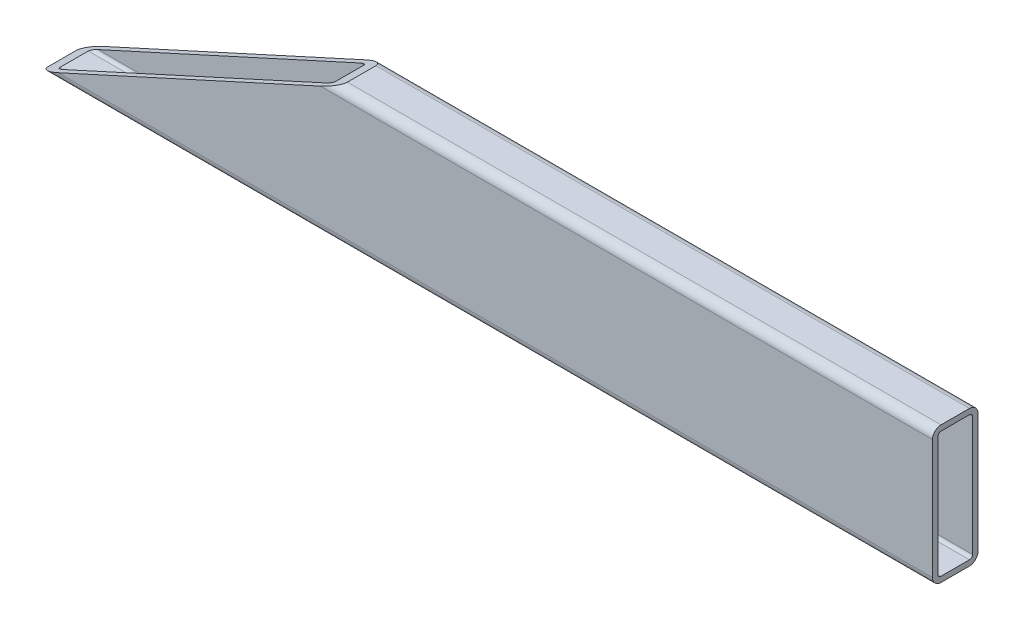
ISO-10303-21;
HEADER;
FILE_DESCRIPTION(('STEP AP214'),'2;1');
FILE_NAME('part.step','',(''),(''),'','','');
FILE_SCHEMA(('AUTOMOTIVE_DESIGN { 1 0 10303 214 1 1 1 1 }'));
ENDSEC;
DATA;
#1=APPLICATION_CONTEXT('core data for automotive mechanical design processes');
#2=APPLICATION_PROTOCOL_DEFINITION('international standard','automotive_design',2000,#1);
#3=PRODUCT_CONTEXT('',#1,'mechanical');
#4=PRODUCT('Part','Part','',(#3));
#5=PRODUCT_RELATED_PRODUCT_CATEGORY('part','',(#4));
#6=PRODUCT_DEFINITION_FORMATION('','',#4);
#7=PRODUCT_DEFINITION_CONTEXT('part definition',#1,'design');
#8=PRODUCT_DEFINITION('design','',#6,#7);
#9=PRODUCT_DEFINITION_SHAPE('','',#8);
#10=(LENGTH_UNIT() NAMED_UNIT(*) SI_UNIT(.MILLI.,.METRE.));
#11=(NAMED_UNIT(*) PLANE_ANGLE_UNIT() SI_UNIT($,.RADIAN.));
#12=(NAMED_UNIT(*) SI_UNIT($,.STERADIAN.) SOLID_ANGLE_UNIT());
#13=UNCERTAINTY_MEASURE_WITH_UNIT(LENGTH_MEASURE(1.E-05),#10,'distance_accuracy_value','');
#14=(GEOMETRIC_REPRESENTATION_CONTEXT(3) GLOBAL_UNCERTAINTY_ASSIGNED_CONTEXT((#13)) GLOBAL_UNIT_ASSIGNED_CONTEXT((#10,
#11,#12)) REPRESENTATION_CONTEXT('',''));
#15=CARTESIAN_POINT('',(0.,0.,0.));
#16=DIRECTION('',(0.,0.,1.));
#17=DIRECTION('',(1.,0.,0.));
#18=AXIS2_PLACEMENT_3D('',#15,#16,#17);
#19=CARTESIAN_POINT('',(-249.2375,33.3375,7.93750000000006));
#20=DIRECTION('',(1.,0.,0.));
#21=DIRECTION('',(0.,0.,-1.));
#22=AXIS2_PLACEMENT_3D('',#19,#20,#21);
#23=CYLINDRICAL_SURFACE('',#22,4.7625);
#24=CARTESIAN_POINT('',(-92.4822129548996,33.3375,7.93750000000002));
#25=DIRECTION('',(-0.414693242656243,0.909961270876541,0.));
#26=DIRECTION('',(0.909961270876541,0.414693242656243,0.));
#27=AXIS2_PLACEMENT_3D('',#24,#25,#26);
#28=ELLIPSE('',#27,11.4843925825621,4.7625);
#29=CARTESIAN_POINT('',(-92.4822129548995,33.3375,12.7));
#30=VERTEX_POINT('',#29);
#31=CARTESIAN_POINT('',(-82.0318604852262,38.1,7.93750000000006));
#32=VERTEX_POINT('',#31);
#33=EDGE_CURVE('E219',#30,#32,#28,.T.);
#34=ORIENTED_EDGE('',*,*,#33,.F.);
#35=DIRECTION('',(1.,0.,0.));
#36=VECTOR('',#35,1.);
#37=CARTESIAN_POINT('',(-249.2375,33.3375,12.7000000000001));
#38=LINE('',#37,#36);
#39=CARTESIAN_POINT('',(249.2375,33.3375,12.6999999999999));
#40=VERTEX_POINT('',#39);
#41=EDGE_CURVE('E154',#30,#40,#38,.T.);
#42=ORIENTED_EDGE('',*,*,#41,.T.);
#43=CARTESIAN_POINT('',(249.2375,33.3375,7.93749999999991));
#44=DIRECTION('',(-1.,0.,0.));
#45=DIRECTION('',(0.,0.,1.));
#46=AXIS2_PLACEMENT_3D('',#43,#44,#45);
#47=CIRCLE('',#46,4.7625);
#48=CARTESIAN_POINT('',(249.2375,38.1,7.93749999999991));
#49=VERTEX_POINT('',#48);
#50=EDGE_CURVE('E168',#40,#49,#47,.T.);
#51=ORIENTED_EDGE('',*,*,#50,.T.);
#52=DIRECTION('',(1.,0.,0.));
#53=VECTOR('',#52,1.);
#54=CARTESIAN_POINT('',(-249.2375,38.1,7.93750000000006));
#55=LINE('',#54,#53);
#56=EDGE_CURVE('E12',#32,#49,#55,.T.);
#57=ORIENTED_EDGE('',*,*,#56,.F.);
#58=EDGE_LOOP('',(#34,#42,#51,#57));
#59=FACE_BOUND('',#58,.T.);
#60=ADVANCED_FACE('F61',(#59),#23,.T.);
#61=CARTESIAN_POINT('',(-249.2375,38.1,7.93750000000006));
#62=DIRECTION('',(0.,-1.,0.));
#63=DIRECTION('',(0.,0.,-1.));
#64=AXIS2_PLACEMENT_3D('',#61,#62,#63);
#65=PLANE('',#64);
#66=DIRECTION('',(0.,0.,1.));
#67=VECTOR('',#66,1.);
#68=CARTESIAN_POINT('',(-82.0318604852262,38.1,-12.7000000000001));
#69=LINE('',#68,#67);
#70=CARTESIAN_POINT('',(-82.0318604852262,38.1,-7.93749999999996));
#71=VERTEX_POINT('',#70);
#72=EDGE_CURVE('E318',#71,#32,#69,.T.);
#73=ORIENTED_EDGE('',*,*,#72,.T.);
#74=ORIENTED_EDGE('',*,*,#56,.T.);
#75=DIRECTION('',(0.,0.,-1.));
#76=VECTOR('',#75,1.);
#77=CARTESIAN_POINT('',(249.2375,38.1,7.93749999999991));
#78=LINE('',#77,#76);
#79=CARTESIAN_POINT('',(249.2375,38.1,-7.93750000000009));
#80=VERTEX_POINT('',#79);
#81=EDGE_CURVE('E240',#49,#80,#78,.T.);
#82=ORIENTED_EDGE('',*,*,#81,.T.);
#83=DIRECTION('',(1.,0.,0.));
#84=VECTOR('',#83,1.);
#85=CARTESIAN_POINT('',(-249.2375,38.1,-7.93749999999994));
#86=LINE('',#85,#84);
#87=EDGE_CURVE('E70',#71,#80,#86,.T.);
#88=ORIENTED_EDGE('',*,*,#87,.F.);
#89=EDGE_LOOP('',(#73,#74,#82,#88));
#90=FACE_BOUND('',#89,.T.);
#91=ADVANCED_FACE('F319',(#90),#65,.F.);
#92=CARTESIAN_POINT('',(-249.2375,33.3375,-7.93749999999994));
#93=DIRECTION('',(1.,0.,0.));
#94=DIRECTION('',(0.,0.,-1.));
#95=AXIS2_PLACEMENT_3D('',#92,#93,#94);
#96=CYLINDRICAL_SURFACE('',#95,4.7625);
#97=CARTESIAN_POINT('',(-92.4822129548996,33.3375,-7.93749999999998));
#98=DIRECTION('',(-0.414693242656243,0.909961270876541,0.));
#99=DIRECTION('',(0.909961270876541,0.414693242656243,0.));
#100=AXIS2_PLACEMENT_3D('',#97,#98,#99);
#101=ELLIPSE('',#100,11.4843925825621,4.7625);
#102=CARTESIAN_POINT('',(-92.4822129548996,33.3375,-12.7000000000001));
#103=VERTEX_POINT('',#102);
#104=EDGE_CURVE('E315',#71,#103,#101,.T.);
#105=ORIENTED_EDGE('',*,*,#104,.F.);
#106=ORIENTED_EDGE('',*,*,#87,.T.);
#107=CARTESIAN_POINT('',(249.2375,33.3375,-7.93750000000009));
#108=DIRECTION('',(-1.,0.,0.));
#109=DIRECTION('',(0.,0.,1.));
#110=AXIS2_PLACEMENT_3D('',#107,#108,#109);
#111=CIRCLE('',#110,4.7625);
#112=CARTESIAN_POINT('',(249.2375,33.3375,-12.7000000000001));
#113=VERTEX_POINT('',#112);
#114=EDGE_CURVE('E243',#80,#113,#111,.T.);
#115=ORIENTED_EDGE('',*,*,#114,.T.);
#116=DIRECTION('',(1.,0.,0.));
#117=VECTOR('',#116,1.);
#118=CARTESIAN_POINT('',(-249.2375,33.3375,-12.6999999999999));
#119=LINE('',#118,#117);
#120=EDGE_CURVE('E182',#103,#113,#119,.T.);
#121=ORIENTED_EDGE('',*,*,#120,.F.);
#122=EDGE_LOOP('',(#105,#106,#115,#121));
#123=FACE_BOUND('',#122,.T.);
#124=ADVANCED_FACE('F269',(#123),#96,.T.);
#125=CARTESIAN_POINT('',(-249.2375,-33.3375,-12.6999999999999));
#126=DIRECTION('',(0.,0.,1.));
#127=DIRECTION('',(1.,0.,0.));
#128=AXIS2_PLACEMENT_3D('',#125,#126,#127);
#129=PLANE('',#128);
#130=DIRECTION('',(-0.909961270876541,-0.414693242656243,0.));
#131=VECTOR('',#130,1.);
#132=CARTESIAN_POINT('',(-28.4842763777462,62.5030399981183,-12.7000000000001));
#133=LINE('',#132,#131);
#134=CARTESIAN_POINT('',(-238.787147530327,-33.3375,-12.7000000000001));
#135=VERTEX_POINT('',#134);
#136=EDGE_CURVE('E266',#103,#135,#133,.T.);
#137=ORIENTED_EDGE('',*,*,#136,.F.);
#138=ORIENTED_EDGE('',*,*,#120,.T.);
#139=DIRECTION('',(0.,-1.,0.));
#140=VECTOR('',#139,1.);
#141=CARTESIAN_POINT('',(249.2375,-33.3375,-12.7000000000001));
#142=LINE('',#141,#140);
#143=CARTESIAN_POINT('',(249.2375,-33.3375,-12.7000000000001));
#144=VERTEX_POINT('',#143);
#145=EDGE_CURVE('E246',#113,#144,#142,.T.);
#146=ORIENTED_EDGE('',*,*,#145,.T.);
#147=DIRECTION('',(1.,0.,0.));
#148=VECTOR('',#147,1.);
#149=CARTESIAN_POINT('',(-249.2375,-33.3375,-12.6999999999999));
#150=LINE('',#149,#148);
#151=EDGE_CURVE('E180',#135,#144,#150,.T.);
#152=ORIENTED_EDGE('',*,*,#151,.F.);
#153=EDGE_LOOP('',(#137,#138,#146,#152));
#154=FACE_BOUND('',#153,.T.);
#155=ADVANCED_FACE('F263',(#154),#129,.F.);
#156=CARTESIAN_POINT('',(-249.2375,-33.3375,-7.93749999999994));
#157=DIRECTION('',(1.,0.,0.));
#158=DIRECTION('',(0.,0.,-1.));
#159=AXIS2_PLACEMENT_3D('',#156,#157,#158);
#160=CYLINDRICAL_SURFACE('',#159,4.7625);
#161=CARTESIAN_POINT('',(-238.787147530327,-33.3375,-7.93749999999994));
#162=DIRECTION('',(-0.414693242656243,0.909961270876541,0.));
#163=DIRECTION('',(0.909961270876541,0.414693242656243,0.));
#164=AXIS2_PLACEMENT_3D('',#161,#162,#163);
#165=ELLIPSE('',#164,11.4843925825621,4.7625);
#166=CARTESIAN_POINT('',(-249.2375,-38.1,-7.93749999999994));
#167=VERTEX_POINT('',#166);
#168=EDGE_CURVE('E87',#135,#167,#165,.T.);
#169=ORIENTED_EDGE('',*,*,#168,.F.);
#170=ORIENTED_EDGE('',*,*,#151,.T.);
#171=CARTESIAN_POINT('',(249.2375,-33.3375,-7.93750000000009));
#172=DIRECTION('',(-1.,0.,0.));
#173=DIRECTION('',(0.,0.,1.));
#174=AXIS2_PLACEMENT_3D('',#171,#172,#173);
#175=CIRCLE('',#174,4.7625);
#176=CARTESIAN_POINT('',(249.2375,-38.1,-7.93750000000009));
#177=VERTEX_POINT('',#176);
#178=EDGE_CURVE('E249',#144,#177,#175,.T.);
#179=ORIENTED_EDGE('',*,*,#178,.T.);
#180=DIRECTION('',(1.,0.,0.));
#181=VECTOR('',#180,1.);
#182=CARTESIAN_POINT('',(-249.2375,-38.1,-7.93749999999994));
#183=LINE('',#182,#181);
#184=EDGE_CURVE('E177',#167,#177,#183,.T.);
#185=ORIENTED_EDGE('',*,*,#184,.F.);
#186=EDGE_LOOP('',(#169,#170,#179,#185));
#187=FACE_BOUND('',#186,.T.);
#188=ADVANCED_FACE('F258',(#187),#160,.T.);
#189=CARTESIAN_POINT('',(-249.2375,-33.3375,7.93750000000006));
#190=DIRECTION('',(1.,0.,0.));
#191=DIRECTION('',(0.,0.,-1.));
#192=AXIS2_PLACEMENT_3D('',#189,#190,#191);
#193=CYLINDRICAL_SURFACE('',#192,4.7625);
#194=CARTESIAN_POINT('',(-238.787147530327,-33.3375,7.93750000000006));
#195=DIRECTION('',(-0.414693242656243,0.909961270876541,0.));
#196=DIRECTION('',(0.909961270876541,0.414693242656243,0.));
#197=AXIS2_PLACEMENT_3D('',#194,#195,#196);
#198=ELLIPSE('',#197,11.4843925825621,4.7625);
#199=CARTESIAN_POINT('',(-249.2375,-38.1,7.93750000000005));
#200=VERTEX_POINT('',#199);
#201=CARTESIAN_POINT('',(-238.787147530327,-33.3375,12.7));
#202=VERTEX_POINT('',#201);
#203=EDGE_CURVE('E307',#200,#202,#198,.T.);
#204=ORIENTED_EDGE('',*,*,#203,.F.);
#205=DIRECTION('',(1.,0.,0.));
#206=VECTOR('',#205,1.);
#207=CARTESIAN_POINT('',(-249.2375,-38.1,7.93750000000006));
#208=LINE('',#207,#206);
#209=CARTESIAN_POINT('',(249.2375,-38.1,7.93749999999991));
#210=VERTEX_POINT('',#209);
#211=EDGE_CURVE('E153',#200,#210,#208,.T.);
#212=ORIENTED_EDGE('',*,*,#211,.T.);
#213=CARTESIAN_POINT('',(249.2375,-33.3375,7.93749999999991));
#214=DIRECTION('',(-1.,0.,0.));
#215=DIRECTION('',(0.,0.,1.));
#216=AXIS2_PLACEMENT_3D('',#213,#214,#215);
#217=CIRCLE('',#216,4.7625);
#218=CARTESIAN_POINT('',(249.2375,-33.3375,12.6999999999999));
#219=VERTEX_POINT('',#218);
#220=EDGE_CURVE('E158',#210,#219,#217,.T.);
#221=ORIENTED_EDGE('',*,*,#220,.T.);
#222=DIRECTION('',(1.,0.,0.));
#223=VECTOR('',#222,1.);
#224=CARTESIAN_POINT('',(-249.2375,-33.3375,12.7000000000001));
#225=LINE('',#224,#223);
#226=EDGE_CURVE('E141',#202,#219,#225,.T.);
#227=ORIENTED_EDGE('',*,*,#226,.F.);
#228=EDGE_LOOP('',(#204,#212,#221,#227));
#229=FACE_BOUND('',#228,.T.);
#230=ADVANCED_FACE('F159',(#229),#193,.T.);
#231=CARTESIAN_POINT('',(-249.2375,33.3375,-7.93749999999994));
#232=DIRECTION('',(1.,0.,0.));
#233=DIRECTION('',(0.,0.,-1.));
#234=AXIS2_PLACEMENT_3D('',#231,#232,#233);
#235=CYLINDRICAL_SURFACE('',#234,1.71449999999999);
#236=DIRECTION('',(1.,0.,0.));
#237=VECTOR('',#236,1.);
#238=CARTESIAN_POINT('',(-249.2375,35.052,-7.93749999999994));
#239=LINE('',#238,#237);
#240=CARTESIAN_POINT('',(-88.7200860658172,35.052,-7.93750000000009));
#241=VERTEX_POINT('',#240);
#242=CARTESIAN_POINT('',(249.2375,35.052,-7.93750000000009));
#243=VERTEX_POINT('',#242);
#244=EDGE_CURVE('E65',#241,#243,#239,.T.);
#245=ORIENTED_EDGE('',*,*,#244,.F.);
#246=CARTESIAN_POINT('',(-92.4822129548996,33.3375,-7.93749999999998));
#247=DIRECTION('',(-0.414693242656243,0.909961270876541,0.));
#248=DIRECTION('',(0.909961270876541,0.414693242656243,0.));
#249=AXIS2_PLACEMENT_3D('',#246,#247,#248);
#250=ELLIPSE('',#249,4.13438132972235,1.71449999999999);
#251=CARTESIAN_POINT('',(-92.4822129548996,33.3375,-9.65199999999998));
#252=VERTEX_POINT('',#251);
#253=EDGE_CURVE('E304',#241,#252,#250,.T.);
#254=ORIENTED_EDGE('',*,*,#253,.T.);
#255=DIRECTION('',(1.,0.,0.));
#256=VECTOR('',#255,1.);
#257=CARTESIAN_POINT('',(-249.2375,33.3375,-9.65199999999994));
#258=LINE('',#257,#256);
#259=CARTESIAN_POINT('',(249.2375,33.3375,-9.65200000000009));
#260=VERTEX_POINT('',#259);
#261=EDGE_CURVE('E171',#252,#260,#258,.T.);
#262=ORIENTED_EDGE('',*,*,#261,.T.);
#263=CARTESIAN_POINT('',(249.2375,33.3375,-7.93750000000009));
#264=DIRECTION('',(-1.,0.,0.));
#265=DIRECTION('',(0.,0.,1.));
#266=AXIS2_PLACEMENT_3D('',#263,#264,#265);
#267=CIRCLE('',#266,1.71449999999999);
#268=EDGE_CURVE('E214',#243,#260,#267,.T.);
#269=ORIENTED_EDGE('',*,*,#268,.F.);
#270=EDGE_LOOP('',(#245,#254,#262,#269));
#271=FACE_BOUND('',#270,.T.);
#272=ADVANCED_FACE('F63',(#271),#235,.F.);
#273=CARTESIAN_POINT('',(-249.2375,35.052,7.93750000000006));
#274=DIRECTION('',(0.,-1.,0.));
#275=DIRECTION('',(0.,0.,-1.));
#276=AXIS2_PLACEMENT_3D('',#273,#274,#275);
#277=PLANE('',#276);
#278=DIRECTION('',(1.,0.,0.));
#279=VECTOR('',#278,1.);
#280=CARTESIAN_POINT('',(-249.2375,35.052,7.93750000000006));
#281=LINE('',#280,#279);
#282=CARTESIAN_POINT('',(-88.7200860658172,35.052,7.93750000000002));
#283=VERTEX_POINT('',#282);
#284=CARTESIAN_POINT('',(249.2375,35.052,7.93749999999991));
#285=VERTEX_POINT('',#284);
#286=EDGE_CURVE('E195',#283,#285,#281,.T.);
#287=ORIENTED_EDGE('',*,*,#286,.F.);
#288=DIRECTION('',(0.,0.,-1.));
#289=VECTOR('',#288,1.);
#290=CARTESIAN_POINT('',(-88.7200860658172,35.052,7.93750000000006));
#291=LINE('',#290,#289);
#292=EDGE_CURVE('E210',#283,#241,#291,.T.);
#293=ORIENTED_EDGE('',*,*,#292,.T.);
#294=ORIENTED_EDGE('',*,*,#244,.T.);
#295=DIRECTION('',(0.,0.,-1.));
#296=VECTOR('',#295,1.);
#297=CARTESIAN_POINT('',(249.2375,35.052,7.93749999999991));
#298=LINE('',#297,#296);
#299=EDGE_CURVE('E207',#285,#243,#298,.T.);
#300=ORIENTED_EDGE('',*,*,#299,.F.);
#301=EDGE_LOOP('',(#287,#293,#294,#300));
#302=FACE_BOUND('',#301,.T.);
#303=ADVANCED_FACE('F205',(#302),#277,.T.);
#304=CARTESIAN_POINT('',(-249.2375,33.3375,7.93750000000006));
#305=DIRECTION('',(1.,0.,0.));
#306=DIRECTION('',(0.,0.,-1.));
#307=AXIS2_PLACEMENT_3D('',#304,#305,#306);
#308=CYLINDRICAL_SURFACE('',#307,1.71449999999999);
#309=DIRECTION('',(1.,0.,0.));
#310=VECTOR('',#309,1.);
#311=CARTESIAN_POINT('',(-249.2375,33.3375,9.65200000000006));
#312=LINE('',#311,#310);
#313=CARTESIAN_POINT('',(-92.4822129548996,33.3375,9.65200000000002));
#314=VERTEX_POINT('',#313);
#315=CARTESIAN_POINT('',(249.2375,33.3375,9.6519999999999));
#316=VERTEX_POINT('',#315);
#317=EDGE_CURVE('E194',#314,#316,#312,.T.);
#318=ORIENTED_EDGE('',*,*,#317,.F.);
#319=CARTESIAN_POINT('',(-92.4822129548996,33.3375,7.93750000000002));
#320=DIRECTION('',(-0.414693242656243,0.909961270876541,0.));
#321=DIRECTION('',(0.909961270876541,0.414693242656243,0.));
#322=AXIS2_PLACEMENT_3D('',#319,#320,#321);
#323=ELLIPSE('',#322,4.13438132972235,1.71449999999999);
#324=EDGE_CURVE('E310',#314,#283,#323,.T.);
#325=ORIENTED_EDGE('',*,*,#324,.T.);
#326=ORIENTED_EDGE('',*,*,#286,.T.);
#327=CARTESIAN_POINT('',(249.2375,33.3375,7.93749999999991));
#328=DIRECTION('',(-1.,0.,0.));
#329=DIRECTION('',(0.,0.,1.));
#330=AXIS2_PLACEMENT_3D('',#327,#328,#329);
#331=CIRCLE('',#330,1.71449999999999);
#332=EDGE_CURVE('E222',#316,#285,#331,.T.);
#333=ORIENTED_EDGE('',*,*,#332,.F.);
#334=EDGE_LOOP('',(#318,#325,#326,#333));
#335=FACE_BOUND('',#334,.T.);
#336=ADVANCED_FACE('F335',(#335),#308,.F.);
#337=CARTESIAN_POINT('',(-249.2375,33.3375,9.65200000000006));
#338=DIRECTION('',(0.,0.,-1.));
#339=DIRECTION('',(-1.,0.,0.));
#340=AXIS2_PLACEMENT_3D('',#337,#338,#339);
#341=PLANE('',#340);
#342=DIRECTION('',(1.,0.,0.));
#343=VECTOR('',#342,1.);
#344=CARTESIAN_POINT('',(-249.2375,-33.3375,9.65200000000006));
#345=LINE('',#344,#343);
#346=CARTESIAN_POINT('',(-238.787147530327,-33.3375,9.65200000000006));
#347=VERTEX_POINT('',#346);
#348=CARTESIAN_POINT('',(249.2375,-33.3375,9.65199999999991));
#349=VERTEX_POINT('',#348);
#350=EDGE_CURVE('E192',#347,#349,#345,.T.);
#351=ORIENTED_EDGE('',*,*,#350,.F.);
#352=DIRECTION('',(0.909961270876541,0.414693242656243,0.));
#353=VECTOR('',#352,1.);
#354=CARTESIAN_POINT('',(-222.280217181418,-25.8148584417544,9.65200000000005));
#355=LINE('',#354,#353);
#356=EDGE_CURVE('E332',#347,#314,#355,.T.);
#357=ORIENTED_EDGE('',*,*,#356,.T.);
#358=ORIENTED_EDGE('',*,*,#317,.T.);
#359=DIRECTION('',(0.,1.,0.));
#360=VECTOR('',#359,1.);
#361=CARTESIAN_POINT('',(249.2375,33.3375,9.65199999999991));
#362=LINE('',#361,#360);
#363=EDGE_CURVE('E224',#349,#316,#362,.T.);
#364=ORIENTED_EDGE('',*,*,#363,.F.);
#365=EDGE_LOOP('',(#351,#357,#358,#364));
#366=FACE_BOUND('',#365,.T.);
#367=ADVANCED_FACE('F338',(#366),#341,.T.);
#368=CARTESIAN_POINT('',(-249.2375,-33.3375,7.93750000000006));
#369=DIRECTION('',(1.,0.,0.));
#370=DIRECTION('',(0.,0.,-1.));
#371=AXIS2_PLACEMENT_3D('',#368,#369,#370);
#372=CYLINDRICAL_SURFACE('',#371,1.71449999999999);
#373=DIRECTION('',(1.,0.,0.));
#374=VECTOR('',#373,1.);
#375=CARTESIAN_POINT('',(-249.2375,-35.052,7.93750000000006));
#376=LINE('',#375,#374);
#377=CARTESIAN_POINT('',(-242.549274419409,-35.052,7.93750000000006));
#378=VERTEX_POINT('',#377);
#379=CARTESIAN_POINT('',(249.2375,-35.052,7.93749999999991));
#380=VERTEX_POINT('',#379);
#381=EDGE_CURVE('E190',#378,#380,#376,.T.);
#382=ORIENTED_EDGE('',*,*,#381,.F.);
#383=CARTESIAN_POINT('',(-238.787147530327,-33.3375,7.93750000000006));
#384=DIRECTION('',(-0.414693242656243,0.909961270876541,0.));
#385=DIRECTION('',(0.909961270876541,0.414693242656243,0.));
#386=AXIS2_PLACEMENT_3D('',#383,#384,#385);
#387=ELLIPSE('',#386,4.13438132972235,1.71449999999999);
#388=EDGE_CURVE('E329',#378,#347,#387,.T.);
#389=ORIENTED_EDGE('',*,*,#388,.T.);
#390=ORIENTED_EDGE('',*,*,#350,.T.);
#391=CARTESIAN_POINT('',(249.2375,-33.3375,7.93749999999991));
#392=DIRECTION('',(-1.,0.,0.));
#393=DIRECTION('',(0.,0.,1.));
#394=AXIS2_PLACEMENT_3D('',#391,#392,#393);
#395=CIRCLE('',#394,1.71449999999999);
#396=EDGE_CURVE('E228',#380,#349,#395,.T.);
#397=ORIENTED_EDGE('',*,*,#396,.F.);
#398=EDGE_LOOP('',(#382,#389,#390,#397));
#399=FACE_BOUND('',#398,.T.);
#400=ADVANCED_FACE('F343',(#399),#372,.F.);
#401=CARTESIAN_POINT('',(-249.2375,-35.052,-7.93749999999994));
#402=DIRECTION('',(0.,1.,0.));
#403=DIRECTION('',(0.,0.,1.));
#404=AXIS2_PLACEMENT_3D('',#401,#402,#403);
#405=PLANE('',#404);
#406=DIRECTION('',(1.,0.,0.));
#407=VECTOR('',#406,1.);
#408=CARTESIAN_POINT('',(-249.2375,-35.052,-7.93749999999994));
#409=LINE('',#408,#407);
#410=CARTESIAN_POINT('',(-242.549274419409,-35.052,-7.93749999999994));
#411=VERTEX_POINT('',#410);
#412=CARTESIAN_POINT('',(249.2375,-35.052,-7.93750000000009));
#413=VERTEX_POINT('',#412);
#414=EDGE_CURVE('E188',#411,#413,#409,.T.);
#415=ORIENTED_EDGE('',*,*,#414,.F.);
#416=DIRECTION('',(0.,0.,1.));
#417=VECTOR('',#416,1.);
#418=CARTESIAN_POINT('',(-242.549274419409,-35.052,-7.93749999999994));
#419=LINE('',#418,#417);
#420=EDGE_CURVE('E326',#411,#378,#419,.T.);
#421=ORIENTED_EDGE('',*,*,#420,.T.);
#422=ORIENTED_EDGE('',*,*,#381,.T.);
#423=DIRECTION('',(0.,0.,1.));
#424=VECTOR('',#423,1.);
#425=CARTESIAN_POINT('',(249.2375,-35.052,-7.93750000000009));
#426=LINE('',#425,#424);
#427=EDGE_CURVE('E231',#413,#380,#426,.T.);
#428=ORIENTED_EDGE('',*,*,#427,.F.);
#429=EDGE_LOOP('',(#415,#421,#422,#428));
#430=FACE_BOUND('',#429,.T.);
#431=ADVANCED_FACE('F346',(#430),#405,.T.);
#432=CARTESIAN_POINT('',(-249.2375,-33.3375,-7.93749999999994));
#433=DIRECTION('',(1.,0.,0.));
#434=DIRECTION('',(0.,0.,-1.));
#435=AXIS2_PLACEMENT_3D('',#432,#433,#434);
#436=CYLINDRICAL_SURFACE('',#435,1.71449999999999);
#437=DIRECTION('',(1.,0.,0.));
#438=VECTOR('',#437,1.);
#439=CARTESIAN_POINT('',(-249.2375,-33.3375,-9.65199999999993));
#440=LINE('',#439,#438);
#441=CARTESIAN_POINT('',(-238.787147530327,-33.3375,-9.65199999999994));
#442=VERTEX_POINT('',#441);
#443=CARTESIAN_POINT('',(249.2375,-33.3375,-9.65200000000008));
#444=VERTEX_POINT('',#443);
#445=EDGE_CURVE('E186',#442,#444,#440,.T.);
#446=ORIENTED_EDGE('',*,*,#445,.F.);
#447=CARTESIAN_POINT('',(-238.787147530327,-33.3375,-7.93749999999994));
#448=DIRECTION('',(-0.414693242656243,0.909961270876541,0.));
#449=DIRECTION('',(0.909961270876541,0.414693242656243,0.));
#450=AXIS2_PLACEMENT_3D('',#447,#448,#449);
#451=ELLIPSE('',#450,4.13438132972235,1.71449999999999);
#452=EDGE_CURVE('E78',#442,#411,#451,.T.);
#453=ORIENTED_EDGE('',*,*,#452,.T.);
#454=ORIENTED_EDGE('',*,*,#414,.T.);
#455=CARTESIAN_POINT('',(249.2375,-33.3375,-7.93750000000009));
#456=DIRECTION('',(-1.,0.,0.));
#457=DIRECTION('',(0.,0.,1.));
#458=AXIS2_PLACEMENT_3D('',#455,#456,#457);
#459=CIRCLE('',#458,1.71449999999999);
#460=EDGE_CURVE('E234',#444,#413,#459,.T.);
#461=ORIENTED_EDGE('',*,*,#460,.F.);
#462=EDGE_LOOP('',(#446,#453,#454,#461));
#463=FACE_BOUND('',#462,.T.);
#464=ADVANCED_FACE('F351',(#463),#436,.F.);
#465=CARTESIAN_POINT('',(-249.2375,-33.3375,-9.65199999999994));
#466=DIRECTION('',(0.,0.,1.));
#467=DIRECTION('',(1.,0.,0.));
#468=AXIS2_PLACEMENT_3D('',#465,#466,#467);
#469=PLANE('',#468);
#470=ORIENTED_EDGE('',*,*,#261,.F.);
#471=DIRECTION('',(-0.909961270876541,-0.414693242656243,0.));
#472=VECTOR('',#471,1.);
#473=CARTESIAN_POINT('',(-247.440347812095,-37.2809905627836,-9.65199999999994));
#474=LINE('',#473,#472);
#475=EDGE_CURVE('E306',#252,#442,#474,.T.);
#476=ORIENTED_EDGE('',*,*,#475,.T.);
#477=ORIENTED_EDGE('',*,*,#445,.T.);
#478=DIRECTION('',(0.,-1.,0.));
#479=VECTOR('',#478,1.);
#480=CARTESIAN_POINT('',(249.2375,-33.3375,-9.65200000000009));
#481=LINE('',#480,#479);
#482=EDGE_CURVE('E237',#260,#444,#481,.T.);
#483=ORIENTED_EDGE('',*,*,#482,.F.);
#484=EDGE_LOOP('',(#470,#476,#477,#483));
#485=FACE_BOUND('',#484,.T.);
#486=ADVANCED_FACE('F353',(#485),#469,.T.);
#487=CARTESIAN_POINT('',(-249.2375,33.3375,12.7000000000001));
#488=DIRECTION('',(0.,0.,-1.));
#489=DIRECTION('',(-1.,0.,0.));
#490=AXIS2_PLACEMENT_3D('',#487,#488,#489);
#491=PLANE('',#490);
#492=DIRECTION('',(-0.909961270876541,-0.414693242656243,0.));
#493=VECTOR('',#492,1.);
#494=CARTESIAN_POINT('',(-28.4842763777462,62.5030399981183,12.7));
#495=LINE('',#494,#493);
#496=EDGE_CURVE('E150',#30,#202,#495,.T.);
#497=ORIENTED_EDGE('',*,*,#496,.T.);
#498=ORIENTED_EDGE('',*,*,#226,.T.);
#499=DIRECTION('',(0.,1.,0.));
#500=VECTOR('',#499,1.);
#501=CARTESIAN_POINT('',(249.2375,33.3375,12.6999999999999));
#502=LINE('',#501,#500);
#503=EDGE_CURVE('E146',#219,#40,#502,.T.);
#504=ORIENTED_EDGE('',*,*,#503,.T.);
#505=ORIENTED_EDGE('',*,*,#41,.F.);
#506=EDGE_LOOP('',(#497,#498,#504,#505));
#507=FACE_BOUND('',#506,.T.);
#508=ADVANCED_FACE('F143',(#507),#491,.F.);
#509=CARTESIAN_POINT('',(-249.2375,-38.1,-7.93749999999994));
#510=DIRECTION('',(0.,1.,0.));
#511=DIRECTION('',(0.,0.,1.));
#512=AXIS2_PLACEMENT_3D('',#509,#510,#511);
#513=PLANE('',#512);
#514=DIRECTION('',(0.,0.,1.));
#515=VECTOR('',#514,1.);
#516=CARTESIAN_POINT('',(249.2375,-38.1,-7.93750000000009));
#517=LINE('',#516,#515);
#518=EDGE_CURVE('E163',#177,#210,#517,.T.);
#519=ORIENTED_EDGE('',*,*,#518,.T.);
#520=ORIENTED_EDGE('',*,*,#211,.F.);
#521=DIRECTION('',(0.,0.,1.));
#522=VECTOR('',#521,1.);
#523=CARTESIAN_POINT('',(-249.2375,-38.1,-7.93749999999994));
#524=LINE('',#523,#522);
#525=EDGE_CURVE('E169',#167,#200,#524,.T.);
#526=ORIENTED_EDGE('',*,*,#525,.F.);
#527=ORIENTED_EDGE('',*,*,#184,.T.);
#528=EDGE_LOOP('',(#519,#520,#526,#527));
#529=FACE_BOUND('',#528,.T.);
#530=ADVANCED_FACE('F251',(#529),#513,.F.);
#531=CARTESIAN_POINT('',(249.2375,33.3375,7.93749999999991));
#532=DIRECTION('',(-1.,0.,0.));
#533=DIRECTION('',(0.,0.,1.));
#534=AXIS2_PLACEMENT_3D('',#531,#532,#533);
#535=PLANE('',#534);
#536=ORIENTED_EDGE('',*,*,#268,.T.);
#537=ORIENTED_EDGE('',*,*,#482,.T.);
#538=ORIENTED_EDGE('',*,*,#460,.T.);
#539=ORIENTED_EDGE('',*,*,#427,.T.);
#540=ORIENTED_EDGE('',*,*,#396,.T.);
#541=ORIENTED_EDGE('',*,*,#363,.T.);
#542=ORIENTED_EDGE('',*,*,#332,.T.);
#543=ORIENTED_EDGE('',*,*,#299,.T.);
#544=EDGE_LOOP('',(#536,#537,#538,#539,#540,#541,#542,#543));
#545=FACE_BOUND('',#544,.T.);
#546=ORIENTED_EDGE('',*,*,#50,.F.);
#547=ORIENTED_EDGE('',*,*,#503,.F.);
#548=ORIENTED_EDGE('',*,*,#220,.F.);
#549=ORIENTED_EDGE('',*,*,#518,.F.);
#550=ORIENTED_EDGE('',*,*,#178,.F.);
#551=ORIENTED_EDGE('',*,*,#145,.F.);
#552=ORIENTED_EDGE('',*,*,#114,.F.);
#553=ORIENTED_EDGE('',*,*,#81,.F.);
#554=EDGE_LOOP('',(#546,#547,#548,#549,#550,#551,#552,#553));
#555=FACE_BOUND('',#554,.T.);
#556=ADVANCED_FACE('F165',(#545,#555),#535,.F.);
#557=CARTESIAN_POINT('',(-28.4842763777462,62.5030399981183,-12.7000000000001));
#558=DIRECTION('',(-0.414693242656243,0.909961270876541,0.));
#559=DIRECTION('',(-0.909961270876541,-0.414693242656243,0.));
#560=AXIS2_PLACEMENT_3D('',#557,#558,#559);
#561=PLANE('',#560);
#562=ORIENTED_EDGE('',*,*,#292,.F.);
#563=ORIENTED_EDGE('',*,*,#324,.F.);
#564=ORIENTED_EDGE('',*,*,#356,.F.);
#565=ORIENTED_EDGE('',*,*,#388,.F.);
#566=ORIENTED_EDGE('',*,*,#420,.F.);
#567=ORIENTED_EDGE('',*,*,#452,.F.);
#568=ORIENTED_EDGE('',*,*,#475,.F.);
#569=ORIENTED_EDGE('',*,*,#253,.F.);
#570=EDGE_LOOP('',(#562,#563,#564,#565,#566,#567,#568,#569));
#571=FACE_BOUND('',#570,.T.);
#572=ORIENTED_EDGE('',*,*,#33,.T.);
#573=ORIENTED_EDGE('',*,*,#72,.F.);
#574=ORIENTED_EDGE('',*,*,#104,.T.);
#575=ORIENTED_EDGE('',*,*,#136,.T.);
#576=ORIENTED_EDGE('',*,*,#168,.T.);
#577=ORIENTED_EDGE('',*,*,#525,.T.);
#578=ORIENTED_EDGE('',*,*,#203,.T.);
#579=ORIENTED_EDGE('',*,*,#496,.F.);
#580=EDGE_LOOP('',(#572,#573,#574,#575,#576,#577,#578,#579));
#581=FACE_BOUND('',#580,.T.);
#582=ADVANCED_FACE('F305',(#571,#581),#561,.T.);
#583=CLOSED_SHELL('',(#60,#91,#124,#155,#188,#230,#272,#303,#336,#367,#400,#431,#464,#486,#508,
#530,#556,#582));
#584=MANIFOLD_SOLID_BREP('B2',#583);
#585=ADVANCED_BREP_SHAPE_REPRESENTATION('',(#18,#584),#14);
#586=SHAPE_DEFINITION_REPRESENTATION(#9,#585);
ENDSEC;
END-ISO-10303-21;
